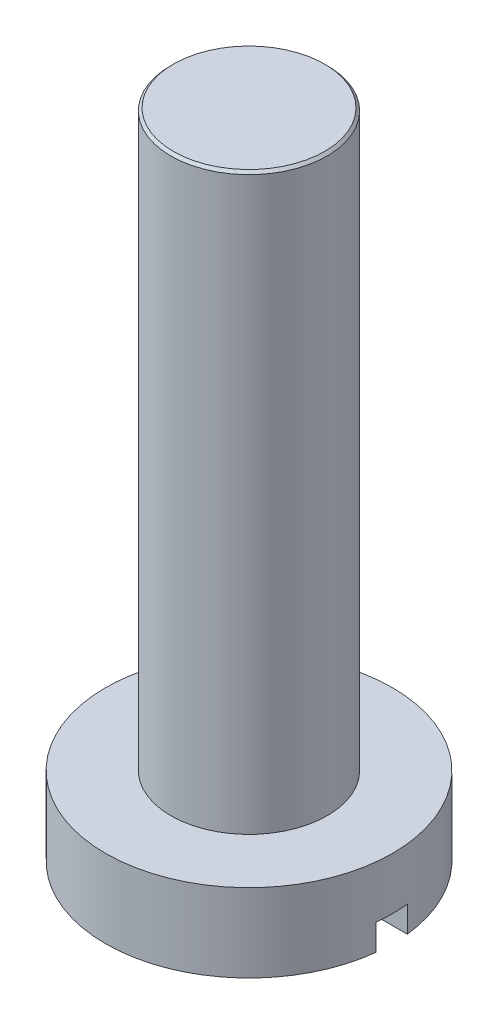
ISO-10303-21;
HEADER;
FILE_DESCRIPTION(('STEP AP214'),'2;1');
FILE_NAME('part.step','',(''),(''),'','','');
FILE_SCHEMA(('AUTOMOTIVE_DESIGN { 1 0 10303 214 1 1 1 1 }'));
ENDSEC;
DATA;
#1=APPLICATION_CONTEXT('core data for automotive mechanical design processes');
#2=APPLICATION_PROTOCOL_DEFINITION('international standard','automotive_design',2000,#1);
#3=PRODUCT_CONTEXT('',#1,'mechanical');
#4=PRODUCT('Part','Part','',(#3));
#5=PRODUCT_RELATED_PRODUCT_CATEGORY('part','',(#4));
#6=PRODUCT_DEFINITION_FORMATION('','',#4);
#7=PRODUCT_DEFINITION_CONTEXT('part definition',#1,'design');
#8=PRODUCT_DEFINITION('design','',#6,#7);
#9=PRODUCT_DEFINITION_SHAPE('','',#8);
#10=(LENGTH_UNIT() NAMED_UNIT(*) SI_UNIT(.MILLI.,.METRE.));
#11=(NAMED_UNIT(*) PLANE_ANGLE_UNIT() SI_UNIT($,.RADIAN.));
#12=(NAMED_UNIT(*) SI_UNIT($,.STERADIAN.) SOLID_ANGLE_UNIT());
#13=UNCERTAINTY_MEASURE_WITH_UNIT(LENGTH_MEASURE(1.E-05),#10,'distance_accuracy_value','');
#14=(GEOMETRIC_REPRESENTATION_CONTEXT(3) GLOBAL_UNCERTAINTY_ASSIGNED_CONTEXT((#13)) GLOBAL_UNIT_ASSIGNED_CONTEXT((#10,
#11,#12)) REPRESENTATION_CONTEXT('',''));
#15=CARTESIAN_POINT('',(0.,0.,0.));
#16=DIRECTION('',(0.,0.,1.));
#17=DIRECTION('',(1.,0.,0.));
#18=AXIS2_PLACEMENT_3D('',#15,#16,#17);
#19=CARTESIAN_POINT('',(0.,-1.5,0.));
#20=DIRECTION('',(0.,-1.,0.));
#21=DIRECTION('',(0.,0.,-1.));
#22=AXIS2_PLACEMENT_3D('',#19,#20,#21);
#23=PLANE('',#22);
#24=DIRECTION('',(1.,0.,0.));
#25=VECTOR('',#24,1.);
#26=CARTESIAN_POINT('',(0.,-1.5,-0.3));
#27=LINE('',#26,#25);
#28=CARTESIAN_POINT('',(-2.73358738656733,-1.5,-0.3));
#29=VERTEX_POINT('',#28);
#30=CARTESIAN_POINT('',(2.73358738656733,-1.5,-0.3));
#31=VERTEX_POINT('',#30);
#32=EDGE_CURVE('E90',#29,#31,#27,.T.);
#33=ORIENTED_EDGE('',*,*,#32,.F.);
#34=CARTESIAN_POINT('',(0.,-1.5,0.));
#35=DIRECTION('',(0.,-1.,0.));
#36=DIRECTION('',(0.,0.,-1.));
#37=AXIS2_PLACEMENT_3D('',#34,#35,#36);
#38=CIRCLE('',#37,2.75);
#39=EDGE_CURVE('E100',#29,#31,#38,.T.);
#40=ORIENTED_EDGE('',*,*,#39,.T.);
#41=EDGE_LOOP('',(#33,#40));
#42=FACE_BOUND('',#41,.T.);
#43=ADVANCED_FACE('F42',(#42),#23,.T.);
#44=CARTESIAN_POINT('',(0.,-1.5,0.));
#45=DIRECTION('',(0.,1.,0.));
#46=DIRECTION('',(0.,0.,1.));
#47=AXIS2_PLACEMENT_3D('',#44,#45,#46);
#48=CYLINDRICAL_SURFACE('',#47,2.75);
#49=CARTESIAN_POINT('',(0.,-1.,0.));
#50=DIRECTION('',(0.,1.,0.));
#51=DIRECTION('',(0.,0.,1.));
#52=AXIS2_PLACEMENT_3D('',#49,#50,#51);
#53=CIRCLE('',#52,2.75);
#54=CARTESIAN_POINT('',(2.73358738656733,-1.,0.3));
#55=VERTEX_POINT('',#54);
#56=CARTESIAN_POINT('',(2.73358738656733,-1.,-0.3));
#57=VERTEX_POINT('',#56);
#58=EDGE_CURVE('E12',#55,#57,#53,.T.);
#59=ORIENTED_EDGE('',*,*,#58,.T.);
#60=DIRECTION('',(0.,1.,0.));
#61=VECTOR('',#60,1.);
#62=CARTESIAN_POINT('',(2.73358738656733,-1.5,-0.3));
#63=LINE('',#62,#61);
#64=EDGE_CURVE('E65',#57,#31,#63,.F.);
#65=ORIENTED_EDGE('',*,*,#64,.T.);
#66=ORIENTED_EDGE('',*,*,#39,.F.);
#67=DIRECTION('',(0.,1.,0.));
#68=VECTOR('',#67,1.);
#69=CARTESIAN_POINT('',(-2.73358738656733,-1.5,-0.3));
#70=LINE('',#69,#68);
#71=CARTESIAN_POINT('',(-2.73358738656733,-1.,-0.3));
#72=VERTEX_POINT('',#71);
#73=EDGE_CURVE('E106',#29,#72,#70,.T.);
#74=ORIENTED_EDGE('',*,*,#73,.T.);
#75=CARTESIAN_POINT('',(-2.73358738656733,-1.,0.3));
#76=VERTEX_POINT('',#75);
#77=EDGE_CURVE('E46',#72,#76,#53,.T.);
#78=ORIENTED_EDGE('',*,*,#77,.T.);
#79=DIRECTION('',(0.,1.,0.));
#80=VECTOR('',#79,1.);
#81=CARTESIAN_POINT('',(-2.73358738656733,-1.5,0.3));
#82=LINE('',#81,#80);
#83=CARTESIAN_POINT('',(-2.73358738656733,-1.5,0.3));
#84=VERTEX_POINT('',#83);
#85=EDGE_CURVE('E85',#76,#84,#82,.F.);
#86=ORIENTED_EDGE('',*,*,#85,.T.);
#87=CARTESIAN_POINT('',(2.73358738656733,-1.5,0.3));
#88=VERTEX_POINT('',#87);
#89=EDGE_CURVE('E91',#88,#84,#38,.T.);
#90=ORIENTED_EDGE('',*,*,#89,.F.);
#91=DIRECTION('',(0.,1.,0.));
#92=VECTOR('',#91,1.);
#93=CARTESIAN_POINT('',(2.73358738656733,-1.5,0.3));
#94=LINE('',#93,#92);
#95=EDGE_CURVE('E57',#88,#55,#94,.T.);
#96=ORIENTED_EDGE('',*,*,#95,.T.);
#97=EDGE_LOOP('',(#59,#65,#66,#74,#78,#86,#90,#96));
#98=FACE_BOUND('',#97,.T.);
#99=CARTESIAN_POINT('',(0.,0.,0.));
#100=DIRECTION('',(0.,-1.,0.));
#101=DIRECTION('',(0.,0.,-1.));
#102=AXIS2_PLACEMENT_3D('',#99,#100,#101);
#103=CIRCLE('',#102,2.75);
#104=CARTESIAN_POINT('',(0.,0.,-2.75));
#105=VERTEX_POINT('',#104);
#106=EDGE_CURVE('E103',#105,#105,#103,.T.);
#107=ORIENTED_EDGE('',*,*,#106,.T.);
#108=EDGE_LOOP('',(#107));
#109=FACE_BOUND('',#108,.T.);
#110=ADVANCED_FACE('F44',(#98,#109),#48,.T.);
#111=DIRECTION('',(-1.,0.,0.));
#112=VECTOR('',#111,1.);
#113=CARTESIAN_POINT('',(0.,-1.5,0.3));
#114=LINE('',#113,#112);
#115=EDGE_CURVE('E82',#88,#84,#114,.T.);
#116=ORIENTED_EDGE('',*,*,#115,.F.);
#117=ORIENTED_EDGE('',*,*,#89,.T.);
#118=EDGE_LOOP('',(#116,#117));
#119=FACE_BOUND('',#118,.T.);
#120=ADVANCED_FACE('F99',(#119),#23,.T.);
#121=CARTESIAN_POINT('',(0.,0.,0.));
#122=DIRECTION('',(0.,-1.,0.));
#123=DIRECTION('',(0.,0.,-1.));
#124=AXIS2_PLACEMENT_3D('',#121,#122,#123);
#125=PLANE('',#124);
#126=ORIENTED_EDGE('',*,*,#106,.F.);
#127=EDGE_LOOP('',(#126));
#128=FACE_BOUND('',#127,.T.);
#129=ADVANCED_FACE('F120',(#128),#125,.F.);
#130=CARTESIAN_POINT('',(0.,-1.,0.));
#131=DIRECTION('',(0.,1.,0.));
#132=DIRECTION('',(0.,0.,1.));
#133=AXIS2_PLACEMENT_3D('',#130,#131,#132);
#134=PLANE('',#133);
#135=DIRECTION('',(-1.,0.,0.));
#136=VECTOR('',#135,1.);
#137=CARTESIAN_POINT('',(-4.09817586391625,-1.,0.3));
#138=LINE('',#137,#136);
#139=EDGE_CURVE('E171',#55,#76,#138,.T.);
#140=ORIENTED_EDGE('',*,*,#139,.T.);
#141=ORIENTED_EDGE('',*,*,#77,.F.);
#142=DIRECTION('',(1.,0.,0.));
#143=VECTOR('',#142,1.);
#144=CARTESIAN_POINT('',(-4.09817586391625,-1.,-0.3));
#145=LINE('',#144,#143);
#146=EDGE_CURVE('E97',#72,#57,#145,.T.);
#147=ORIENTED_EDGE('',*,*,#146,.T.);
#148=ORIENTED_EDGE('',*,*,#58,.F.);
#149=EDGE_LOOP('',(#140,#141,#147,#148));
#150=FACE_BOUND('',#149,.T.);
#151=ADVANCED_FACE('F124',(#150),#134,.F.);
#152=CARTESIAN_POINT('',(-4.09817586391625,-1.,-0.3));
#153=DIRECTION('',(0.,0.,-1.));
#154=DIRECTION('',(-1.,0.,0.));
#155=AXIS2_PLACEMENT_3D('',#152,#153,#154);
#156=PLANE('',#155);
#157=ORIENTED_EDGE('',*,*,#32,.T.);
#158=ORIENTED_EDGE('',*,*,#64,.F.);
#159=ORIENTED_EDGE('',*,*,#146,.F.);
#160=ORIENTED_EDGE('',*,*,#73,.F.);
#161=EDGE_LOOP('',(#157,#158,#159,#160));
#162=FACE_BOUND('',#161,.T.);
#163=ADVANCED_FACE('F110',(#162),#156,.F.);
#164=CARTESIAN_POINT('',(-4.09817586391625,-1.,0.3));
#165=DIRECTION('',(0.,0.,1.));
#166=DIRECTION('',(1.,0.,0.));
#167=AXIS2_PLACEMENT_3D('',#164,#165,#166);
#168=PLANE('',#167);
#169=ORIENTED_EDGE('',*,*,#115,.T.);
#170=ORIENTED_EDGE('',*,*,#85,.F.);
#171=ORIENTED_EDGE('',*,*,#139,.F.);
#172=ORIENTED_EDGE('',*,*,#95,.F.);
#173=EDGE_LOOP('',(#169,#170,#171,#172));
#174=FACE_BOUND('',#173,.T.);
#175=ADVANCED_FACE('F84',(#174),#168,.F.);
#176=CLOSED_SHELL('',(#43,#110,#120,#129,#151,#163,#175));
#177=MANIFOLD_SOLID_BREP('B2',#176);
#178=CARTESIAN_POINT('',(0.,11.,0.));
#179=DIRECTION('',(0.,-1.,0.));
#180=DIRECTION('',(0.,0.,-1.));
#181=AXIS2_PLACEMENT_3D('',#178,#179,#180);
#182=CYLINDRICAL_SURFACE('',#181,1.5);
#183=CARTESIAN_POINT('',(0.,10.95,0.));
#184=DIRECTION('',(0.,1.,0.));
#185=DIRECTION('',(0.,0.,1.));
#186=AXIS2_PLACEMENT_3D('',#183,#184,#185);
#187=CIRCLE('',#186,1.5);
#188=CARTESIAN_POINT('',(0.,10.95,1.5));
#189=VERTEX_POINT('',#188);
#190=EDGE_CURVE('E41',#189,#189,#187,.F.);
#191=ORIENTED_EDGE('',*,*,#190,.T.);
#192=EDGE_LOOP('',(#191));
#193=FACE_BOUND('',#192,.T.);
#194=CARTESIAN_POINT('',(0.,0.,0.));
#195=DIRECTION('',(0.,1.,0.));
#196=DIRECTION('',(0.,0.,1.));
#197=AXIS2_PLACEMENT_3D('',#194,#195,#196);
#198=CIRCLE('',#197,1.5);
#199=CARTESIAN_POINT('',(0.,0.,1.5));
#200=VERTEX_POINT('',#199);
#201=EDGE_CURVE('E188',#200,#200,#198,.T.);
#202=ORIENTED_EDGE('',*,*,#201,.T.);
#203=EDGE_LOOP('',(#202));
#204=FACE_BOUND('',#203,.T.);
#205=ADVANCED_FACE('F177',(#193,#204),#182,.T.);
#206=CARTESIAN_POINT('',(0.,11.,0.));
#207=DIRECTION('',(0.,1.,0.));
#208=DIRECTION('',(0.,0.,1.));
#209=AXIS2_PLACEMENT_3D('',#206,#207,#208);
#210=PLANE('',#209);
#211=CARTESIAN_POINT('',(0.,11.,0.));
#212=DIRECTION('',(0.,1.,0.));
#213=DIRECTION('',(0.,0.,1.));
#214=AXIS2_PLACEMENT_3D('',#211,#212,#213);
#215=CIRCLE('',#214,1.45);
#216=CARTESIAN_POINT('',(0.,11.,1.45));
#217=VERTEX_POINT('',#216);
#218=EDGE_CURVE('E184',#217,#217,#215,.T.);
#219=ORIENTED_EDGE('',*,*,#218,.T.);
#220=EDGE_LOOP('',(#219));
#221=FACE_BOUND('',#220,.T.);
#222=ADVANCED_FACE('F198',(#221),#210,.T.);
#223=CARTESIAN_POINT('',(0.,0.,0.));
#224=DIRECTION('',(0.,1.,0.));
#225=DIRECTION('',(0.,0.,1.));
#226=AXIS2_PLACEMENT_3D('',#223,#224,#225);
#227=PLANE('',#226);
#228=ORIENTED_EDGE('',*,*,#201,.F.);
#229=EDGE_LOOP('',(#228));
#230=FACE_BOUND('',#229,.T.);
#231=ADVANCED_FACE('F196',(#230),#227,.F.);
#232=CARTESIAN_POINT('',(0.,11.,0.));
#233=DIRECTION('',(0.,-1.,0.));
#234=DIRECTION('',(0.,0.,-1.));
#235=AXIS2_PLACEMENT_3D('',#232,#233,#234);
#236=CONICAL_SURFACE('',#235,1.45,0.78539816339744);
#237=ORIENTED_EDGE('',*,*,#190,.F.);
#238=EDGE_LOOP('',(#237));
#239=FACE_BOUND('',#238,.T.);
#240=ORIENTED_EDGE('',*,*,#218,.F.);
#241=EDGE_LOOP('',(#240));
#242=FACE_BOUND('',#241,.T.);
#243=ADVANCED_FACE('F179',(#239,#242),#236,.T.);
#244=CLOSED_SHELL('',(#205,#222,#231,#243));
#245=MANIFOLD_SOLID_BREP('B6',#244);
#246=ADVANCED_BREP_SHAPE_REPRESENTATION('',(#18,#177,#245),#14);
#247=SHAPE_DEFINITION_REPRESENTATION(#9,#246);
ENDSEC;
END-ISO-10303-21;
